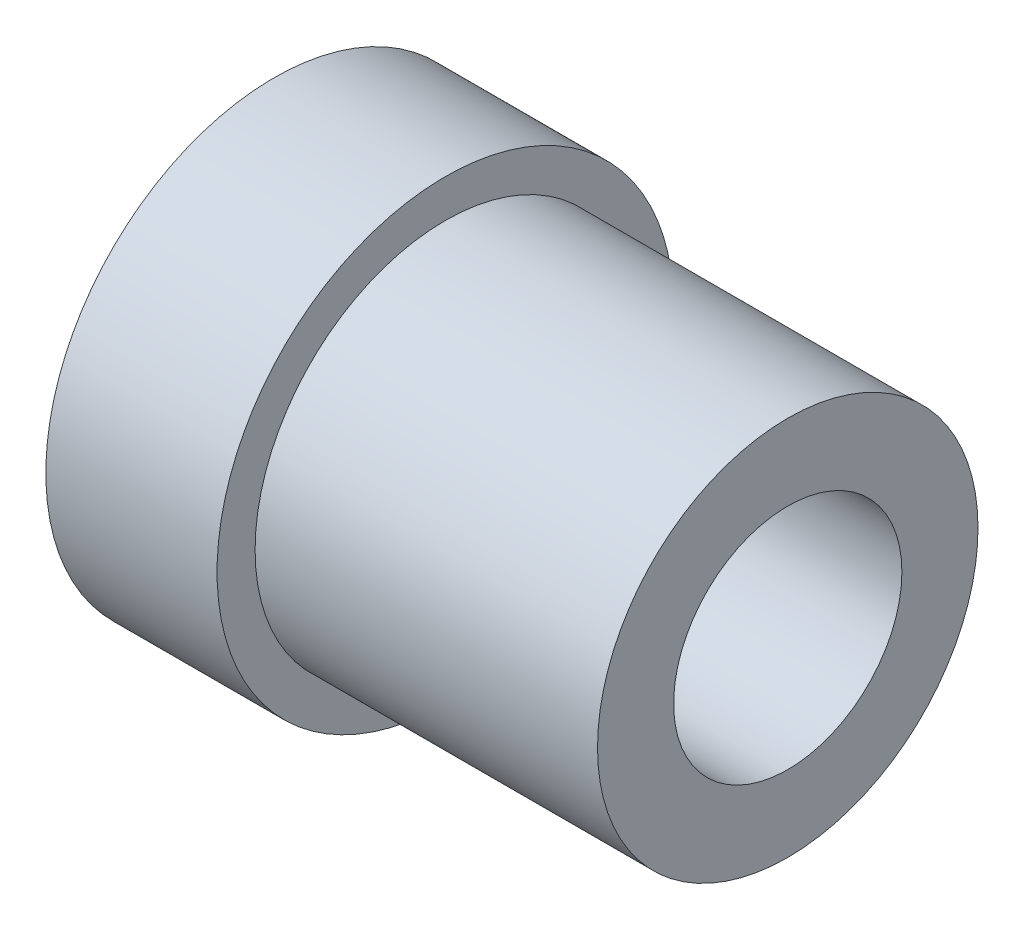
ISO-10303-21;
HEADER;
FILE_DESCRIPTION(('STEP AP214'),'2;1');
FILE_NAME('part.step','',(''),(''),'','','');
FILE_SCHEMA(('AUTOMOTIVE_DESIGN { 1 0 10303 214 1 1 1 1 }'));
ENDSEC;
DATA;
#1=APPLICATION_CONTEXT('core data for automotive mechanical design processes');
#2=APPLICATION_PROTOCOL_DEFINITION('international standard','automotive_design',2000,#1);
#3=PRODUCT_CONTEXT('',#1,'mechanical');
#4=PRODUCT('Part','Part','',(#3));
#5=PRODUCT_RELATED_PRODUCT_CATEGORY('part','',(#4));
#6=PRODUCT_DEFINITION_FORMATION('','',#4);
#7=PRODUCT_DEFINITION_CONTEXT('part definition',#1,'design');
#8=PRODUCT_DEFINITION('design','',#6,#7);
#9=PRODUCT_DEFINITION_SHAPE('','',#8);
#10=(LENGTH_UNIT() NAMED_UNIT(*) SI_UNIT(.MILLI.,.METRE.));
#11=(NAMED_UNIT(*) PLANE_ANGLE_UNIT() SI_UNIT($,.RADIAN.));
#12=(NAMED_UNIT(*) SI_UNIT($,.STERADIAN.) SOLID_ANGLE_UNIT());
#13=UNCERTAINTY_MEASURE_WITH_UNIT(LENGTH_MEASURE(1.E-05),#10,'distance_accuracy_value','');
#14=(GEOMETRIC_REPRESENTATION_CONTEXT(3) GLOBAL_UNCERTAINTY_ASSIGNED_CONTEXT((#13)) GLOBAL_UNIT_ASSIGNED_CONTEXT((#10,
#11,#12)) REPRESENTATION_CONTEXT('',''));
#15=CARTESIAN_POINT('',(0.,0.,0.));
#16=DIRECTION('',(0.,0.,1.));
#17=DIRECTION('',(1.,0.,0.));
#18=AXIS2_PLACEMENT_3D('',#15,#16,#17);
#19=CARTESIAN_POINT('',(4.5,0.,0.));
#20=DIRECTION('',(1.,0.,0.));
#21=DIRECTION('',(0.,0.,-1.));
#22=AXIS2_PLACEMENT_3D('',#19,#20,#21);
#23=PLANE('',#22);
#24=CARTESIAN_POINT('',(4.5,0.,0.));
#25=DIRECTION('',(1.,0.,0.));
#26=DIRECTION('',(0.,0.,-1.));
#27=AXIS2_PLACEMENT_3D('',#24,#25,#26);
#28=CIRCLE('',#27,5.);
#29=CARTESIAN_POINT('',(4.5,0.,-5.));
#30=VERTEX_POINT('',#29);
#31=EDGE_CURVE('E10',#30,#30,#28,.T.);
#32=ORIENTED_EDGE('',*,*,#31,.F.);
#33=EDGE_LOOP('',(#32));
#34=FACE_BOUND('',#33,.T.);
#35=CARTESIAN_POINT('',(4.5,0.,0.));
#36=DIRECTION('',(1.,0.,0.));
#37=DIRECTION('',(0.,0.,-1.));
#38=AXIS2_PLACEMENT_3D('',#35,#36,#37);
#39=CIRCLE('',#38,6.);
#40=CARTESIAN_POINT('',(4.5,0.,-6.));
#41=VERTEX_POINT('',#40);
#42=EDGE_CURVE('E40',#41,#41,#39,.T.);
#43=ORIENTED_EDGE('',*,*,#42,.T.);
#44=EDGE_LOOP('',(#43));
#45=FACE_BOUND('',#44,.T.);
#46=ADVANCED_FACE('F32',(#34,#45),#23,.T.);
#47=CARTESIAN_POINT('',(0.,0.,0.));
#48=DIRECTION('',(1.,0.,0.));
#49=DIRECTION('',(0.,0.,-1.));
#50=AXIS2_PLACEMENT_3D('',#47,#48,#49);
#51=PLANE('',#50);
#52=CARTESIAN_POINT('',(0.,0.,0.));
#53=DIRECTION('',(1.,0.,0.));
#54=DIRECTION('',(0.,0.,-1.));
#55=AXIS2_PLACEMENT_3D('',#52,#53,#54);
#56=CIRCLE('',#55,6.);
#57=CARTESIAN_POINT('',(0.,0.,-6.));
#58=VERTEX_POINT('',#57);
#59=EDGE_CURVE('E36',#58,#58,#56,.T.);
#60=ORIENTED_EDGE('',*,*,#59,.F.);
#61=EDGE_LOOP('',(#60));
#62=FACE_BOUND('',#61,.T.);
#63=CARTESIAN_POINT('',(0.,0.,0.));
#64=DIRECTION('',(1.,0.,0.));
#65=DIRECTION('',(0.,0.,-1.));
#66=AXIS2_PLACEMENT_3D('',#63,#64,#65);
#67=CIRCLE('',#66,3.);
#68=CARTESIAN_POINT('',(0.,0.,-3.));
#69=VERTEX_POINT('',#68);
#70=EDGE_CURVE('E49',#69,#69,#67,.T.);
#71=ORIENTED_EDGE('',*,*,#70,.T.);
#72=EDGE_LOOP('',(#71));
#73=FACE_BOUND('',#72,.T.);
#74=ADVANCED_FACE('F76',(#62,#73),#51,.F.);
#75=CARTESIAN_POINT('',(4.5,0.,0.));
#76=DIRECTION('',(-1.,0.,0.));
#77=DIRECTION('',(0.,0.,1.));
#78=AXIS2_PLACEMENT_3D('',#75,#76,#77);
#79=CYLINDRICAL_SURFACE('',#78,6.);
#80=ORIENTED_EDGE('',*,*,#42,.F.);
#81=EDGE_LOOP('',(#80));
#82=FACE_BOUND('',#81,.T.);
#83=ORIENTED_EDGE('',*,*,#59,.T.);
#84=EDGE_LOOP('',(#83));
#85=FACE_BOUND('',#84,.T.);
#86=ADVANCED_FACE('F34',(#82,#85),#79,.T.);
#87=CARTESIAN_POINT('',(4.5,0.,0.));
#88=DIRECTION('',(-1.,0.,0.));
#89=DIRECTION('',(0.,0.,1.));
#90=AXIS2_PLACEMENT_3D('',#87,#88,#89);
#91=CYLINDRICAL_SURFACE('',#90,3.);
#92=ORIENTED_EDGE('',*,*,#70,.F.);
#93=EDGE_LOOP('',(#92));
#94=FACE_BOUND('',#93,.T.);
#95=CARTESIAN_POINT('',(13.5,0.,0.));
#96=DIRECTION('',(1.,0.,0.));
#97=DIRECTION('',(0.,0.,-1.));
#98=AXIS2_PLACEMENT_3D('',#95,#96,#97);
#99=CIRCLE('',#98,3.);
#100=CARTESIAN_POINT('',(13.5,0.,-3.));
#101=VERTEX_POINT('',#100);
#102=EDGE_CURVE('E55',#101,#101,#99,.T.);
#103=ORIENTED_EDGE('',*,*,#102,.T.);
#104=EDGE_LOOP('',(#103));
#105=FACE_BOUND('',#104,.T.);
#106=ADVANCED_FACE('F61',(#94,#105),#91,.F.);
#107=CARTESIAN_POINT('',(13.5,0.,0.));
#108=DIRECTION('',(1.,0.,0.));
#109=DIRECTION('',(0.,0.,-1.));
#110=AXIS2_PLACEMENT_3D('',#107,#108,#109);
#111=PLANE('',#110);
#112=CARTESIAN_POINT('',(13.5,0.,0.));
#113=DIRECTION('',(1.,0.,0.));
#114=DIRECTION('',(0.,0.,-1.));
#115=AXIS2_PLACEMENT_3D('',#112,#113,#114);
#116=CIRCLE('',#115,5.);
#117=CARTESIAN_POINT('',(13.5,0.,-5.));
#118=VERTEX_POINT('',#117);
#119=EDGE_CURVE('E47',#118,#118,#116,.T.);
#120=ORIENTED_EDGE('',*,*,#119,.T.);
#121=EDGE_LOOP('',(#120));
#122=FACE_BOUND('',#121,.T.);
#123=ORIENTED_EDGE('',*,*,#102,.F.);
#124=EDGE_LOOP('',(#123));
#125=FACE_BOUND('',#124,.T.);
#126=ADVANCED_FACE('F63',(#122,#125),#111,.T.);
#127=CARTESIAN_POINT('',(13.5,0.,0.));
#128=DIRECTION('',(-1.,0.,0.));
#129=DIRECTION('',(0.,0.,1.));
#130=AXIS2_PLACEMENT_3D('',#127,#128,#129);
#131=CYLINDRICAL_SURFACE('',#130,5.);
#132=ORIENTED_EDGE('',*,*,#119,.F.);
#133=EDGE_LOOP('',(#132));
#134=FACE_BOUND('',#133,.T.);
#135=ORIENTED_EDGE('',*,*,#31,.T.);
#136=EDGE_LOOP('',(#135));
#137=FACE_BOUND('',#136,.T.);
#138=ADVANCED_FACE('F65',(#134,#137),#131,.T.);
#139=CLOSED_SHELL('',(#46,#74,#86,#106,#126,#138));
#140=MANIFOLD_SOLID_BREP('B2',#139);
#141=ADVANCED_BREP_SHAPE_REPRESENTATION('',(#18,#140),#14);
#142=SHAPE_DEFINITION_REPRESENTATION(#9,#141);
ENDSEC;
END-ISO-10303-21;
